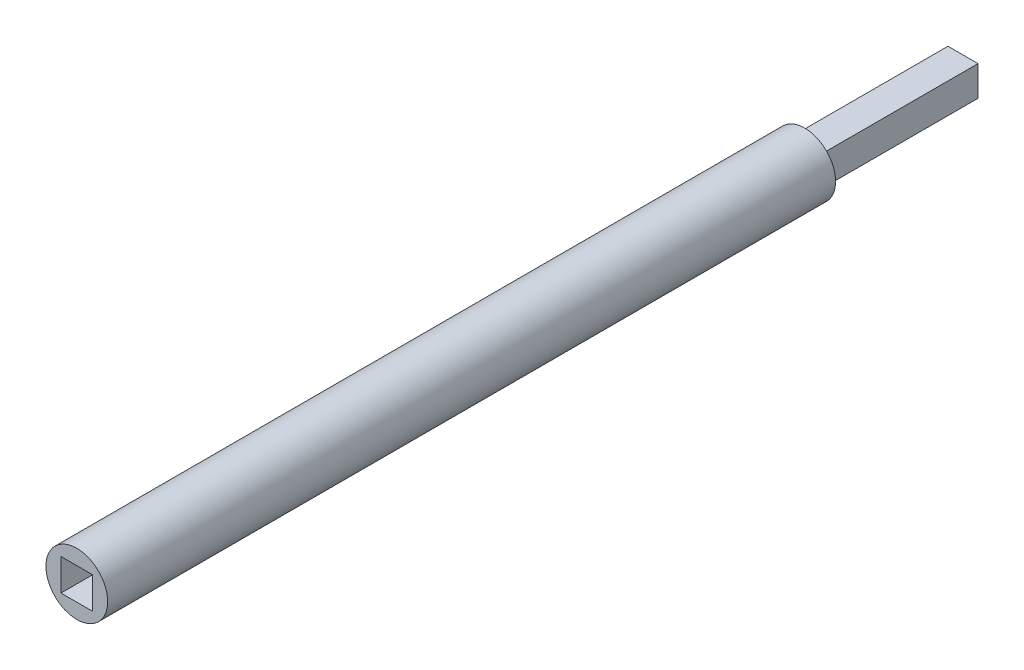
ISO-10303-21;
HEADER;
FILE_DESCRIPTION(('STEP AP214'),'2;1');
FILE_NAME('part.step','',(''),(''),'','','');
FILE_SCHEMA(('AUTOMOTIVE_DESIGN { 1 0 10303 214 1 1 1 1 }'));
ENDSEC;
DATA;
#1=APPLICATION_CONTEXT('core data for automotive mechanical design processes');
#2=APPLICATION_PROTOCOL_DEFINITION('international standard','automotive_design',2000,#1);
#3=PRODUCT_CONTEXT('',#1,'mechanical');
#4=PRODUCT('Part','Part','',(#3));
#5=PRODUCT_RELATED_PRODUCT_CATEGORY('part','',(#4));
#6=PRODUCT_DEFINITION_FORMATION('','',#4);
#7=PRODUCT_DEFINITION_CONTEXT('part definition',#1,'design');
#8=PRODUCT_DEFINITION('design','',#6,#7);
#9=PRODUCT_DEFINITION_SHAPE('','',#8);
#10=(LENGTH_UNIT() NAMED_UNIT(*) SI_UNIT(.MILLI.,.METRE.));
#11=(NAMED_UNIT(*) PLANE_ANGLE_UNIT() SI_UNIT($,.RADIAN.));
#12=(NAMED_UNIT(*) SI_UNIT($,.STERADIAN.) SOLID_ANGLE_UNIT());
#13=UNCERTAINTY_MEASURE_WITH_UNIT(LENGTH_MEASURE(1.E-05),#10,'distance_accuracy_value','');
#14=(GEOMETRIC_REPRESENTATION_CONTEXT(3) GLOBAL_UNCERTAINTY_ASSIGNED_CONTEXT((#13)) GLOBAL_UNIT_ASSIGNED_CONTEXT((#10,
#11,#12)) REPRESENTATION_CONTEXT('',''));
#15=CARTESIAN_POINT('',(0.,0.,0.));
#16=DIRECTION('',(0.,0.,1.));
#17=DIRECTION('',(1.,0.,0.));
#18=AXIS2_PLACEMENT_3D('',#15,#16,#17);
#19=CARTESIAN_POINT('',(0.,0.,0.));
#20=DIRECTION('',(0.,0.,1.));
#21=DIRECTION('',(1.,0.,0.));
#22=AXIS2_PLACEMENT_3D('',#19,#20,#21);
#23=PLANE('',#22);
#24=CARTESIAN_POINT('',(0.,0.,0.));
#25=DIRECTION('',(0.,0.,1.));
#26=DIRECTION('',(1.,0.,0.));
#27=AXIS2_PLACEMENT_3D('',#24,#25,#26);
#28=CIRCLE('',#27,0.975);
#29=CARTESIAN_POINT('',(0.975,0.,0.));
#30=VERTEX_POINT('',#29);
#31=EDGE_CURVE('E48',#30,#30,#28,.T.);
#32=ORIENTED_EDGE('',*,*,#31,.F.);
#33=EDGE_LOOP('',(#32));
#34=FACE_BOUND('',#33,.T.);
#35=DIRECTION('',(0.,1.,0.));
#36=VECTOR('',#35,1.);
#37=CARTESIAN_POINT('',(-0.475,0.475,0.));
#38=LINE('',#37,#36);
#39=CARTESIAN_POINT('',(-0.475,-0.475,0.));
#40=VERTEX_POINT('',#39);
#41=CARTESIAN_POINT('',(-0.475,0.475,0.));
#42=VERTEX_POINT('',#41);
#43=EDGE_CURVE('E68',#40,#42,#38,.T.);
#44=ORIENTED_EDGE('',*,*,#43,.F.);
#45=DIRECTION('',(-1.,0.,0.));
#46=VECTOR('',#45,1.);
#47=CARTESIAN_POINT('',(0.475,-0.475,0.));
#48=LINE('',#47,#46);
#49=CARTESIAN_POINT('',(0.475,-0.475,0.));
#50=VERTEX_POINT('',#49);
#51=EDGE_CURVE('E165',#50,#40,#48,.T.);
#52=ORIENTED_EDGE('',*,*,#51,.F.);
#53=DIRECTION('',(0.,-1.,0.));
#54=VECTOR('',#53,1.);
#55=CARTESIAN_POINT('',(0.475,0.475,0.));
#56=LINE('',#55,#54);
#57=CARTESIAN_POINT('',(0.475,0.475,0.));
#58=VERTEX_POINT('',#57);
#59=EDGE_CURVE('E181',#58,#50,#56,.T.);
#60=ORIENTED_EDGE('',*,*,#59,.F.);
#61=DIRECTION('',(1.,0.,0.));
#62=VECTOR('',#61,1.);
#63=CARTESIAN_POINT('',(0.475,0.475,0.));
#64=LINE('',#63,#62);
#65=EDGE_CURVE('E177',#42,#58,#64,.T.);
#66=ORIENTED_EDGE('',*,*,#65,.F.);
#67=EDGE_LOOP('',(#44,#52,#60,#66));
#68=FACE_BOUND('',#67,.T.);
#69=ADVANCED_FACE('F44',(#34,#68),#23,.F.);
#70=CARTESIAN_POINT('',(0.,0.,23.));
#71=DIRECTION('',(0.,0.,-1.));
#72=DIRECTION('',(-1.,0.,0.));
#73=AXIS2_PLACEMENT_3D('',#70,#71,#72);
#74=CYLINDRICAL_SURFACE('',#73,0.975);
#75=CARTESIAN_POINT('',(0.,0.,23.));
#76=DIRECTION('',(0.,0.,1.));
#77=DIRECTION('',(1.,0.,0.));
#78=AXIS2_PLACEMENT_3D('',#75,#76,#77);
#79=CIRCLE('',#78,0.975);
#80=CARTESIAN_POINT('',(0.975,0.,23.));
#81=VERTEX_POINT('',#80);
#82=EDGE_CURVE('E11',#81,#81,#79,.T.);
#83=ORIENTED_EDGE('',*,*,#82,.F.);
#84=EDGE_LOOP('',(#83));
#85=FACE_BOUND('',#84,.T.);
#86=ORIENTED_EDGE('',*,*,#31,.T.);
#87=EDGE_LOOP('',(#86));
#88=FACE_BOUND('',#87,.T.);
#89=ADVANCED_FACE('F46',(#85,#88),#74,.T.);
#90=CARTESIAN_POINT('',(0.,0.,23.));
#91=DIRECTION('',(0.,0.,1.));
#92=DIRECTION('',(1.,0.,0.));
#93=AXIS2_PLACEMENT_3D('',#90,#91,#92);
#94=PLANE('',#93);
#95=DIRECTION('',(0.,1.,0.));
#96=VECTOR('',#95,1.);
#97=CARTESIAN_POINT('',(0.5,0.5,23.));
#98=LINE('',#97,#96);
#99=CARTESIAN_POINT('',(0.5,-0.5,23.));
#100=VERTEX_POINT('',#99);
#101=CARTESIAN_POINT('',(0.5,0.5,23.));
#102=VERTEX_POINT('',#101);
#103=EDGE_CURVE('E60',#100,#102,#98,.T.);
#104=ORIENTED_EDGE('',*,*,#103,.F.);
#105=DIRECTION('',(1.,0.,0.));
#106=VECTOR('',#105,1.);
#107=CARTESIAN_POINT('',(-0.5,-0.5,23.));
#108=LINE('',#107,#106);
#109=CARTESIAN_POINT('',(-0.5,-0.5,23.));
#110=VERTEX_POINT('',#109);
#111=EDGE_CURVE('E133',#110,#100,#108,.T.);
#112=ORIENTED_EDGE('',*,*,#111,.F.);
#113=DIRECTION('',(0.,-1.,0.));
#114=VECTOR('',#113,1.);
#115=CARTESIAN_POINT('',(-0.5,0.5,23.));
#116=LINE('',#115,#114);
#117=CARTESIAN_POINT('',(-0.5,0.5,23.));
#118=VERTEX_POINT('',#117);
#119=EDGE_CURVE('E137',#118,#110,#116,.T.);
#120=ORIENTED_EDGE('',*,*,#119,.F.);
#121=DIRECTION('',(-1.,0.,0.));
#122=VECTOR('',#121,1.);
#123=CARTESIAN_POINT('',(-0.5,0.5,23.));
#124=LINE('',#123,#122);
#125=EDGE_CURVE('E146',#102,#118,#124,.T.);
#126=ORIENTED_EDGE('',*,*,#125,.F.);
#127=EDGE_LOOP('',(#104,#112,#120,#126));
#128=FACE_BOUND('',#127,.T.);
#129=ORIENTED_EDGE('',*,*,#82,.T.);
#130=EDGE_LOOP('',(#129));
#131=FACE_BOUND('',#130,.T.);
#132=ADVANCED_FACE('F212',(#128,#131),#94,.T.);
#133=CARTESIAN_POINT('',(-0.475,0.475,-5.));
#134=DIRECTION('',(1.,0.,0.));
#135=DIRECTION('',(0.,1.,0.));
#136=AXIS2_PLACEMENT_3D('',#133,#134,#135);
#137=PLANE('',#136);
#138=ORIENTED_EDGE('',*,*,#43,.T.);
#139=DIRECTION('',(0.,0.,1.));
#140=VECTOR('',#139,1.);
#141=CARTESIAN_POINT('',(-0.475,0.475,-5.));
#142=LINE('',#141,#140);
#143=CARTESIAN_POINT('',(-0.475,0.475,-5.));
#144=VERTEX_POINT('',#143);
#145=EDGE_CURVE('E198',#144,#42,#142,.T.);
#146=ORIENTED_EDGE('',*,*,#145,.F.);
#147=DIRECTION('',(0.,1.,0.));
#148=VECTOR('',#147,1.);
#149=CARTESIAN_POINT('',(-0.475,0.475,-5.));
#150=LINE('',#149,#148);
#151=CARTESIAN_POINT('',(-0.475,-0.475,-5.));
#152=VERTEX_POINT('',#151);
#153=EDGE_CURVE('E160',#152,#144,#150,.T.);
#154=ORIENTED_EDGE('',*,*,#153,.F.);
#155=DIRECTION('',(0.,0.,1.));
#156=VECTOR('',#155,1.);
#157=CARTESIAN_POINT('',(-0.475,-0.475,-5.));
#158=LINE('',#157,#156);
#159=EDGE_CURVE('E174',#152,#40,#158,.T.);
#160=ORIENTED_EDGE('',*,*,#159,.T.);
#161=EDGE_LOOP('',(#138,#146,#154,#160));
#162=FACE_BOUND('',#161,.T.);
#163=ADVANCED_FACE('F217',(#162),#137,.F.);
#164=CARTESIAN_POINT('',(0.475,0.475,-5.));
#165=DIRECTION('',(0.,-1.,0.));
#166=DIRECTION('',(0.,0.,-1.));
#167=AXIS2_PLACEMENT_3D('',#164,#165,#166);
#168=PLANE('',#167);
#169=ORIENTED_EDGE('',*,*,#65,.T.);
#170=DIRECTION('',(0.,0.,1.));
#171=VECTOR('',#170,1.);
#172=CARTESIAN_POINT('',(0.475,0.475,-5.));
#173=LINE('',#172,#171);
#174=CARTESIAN_POINT('',(0.475,0.475,-5.));
#175=VERTEX_POINT('',#174);
#176=EDGE_CURVE('E194',#175,#58,#173,.T.);
#177=ORIENTED_EDGE('',*,*,#176,.F.);
#178=DIRECTION('',(1.,0.,0.));
#179=VECTOR('',#178,1.);
#180=CARTESIAN_POINT('',(0.475,0.475,-5.));
#181=LINE('',#180,#179);
#182=EDGE_CURVE('E164',#144,#175,#181,.T.);
#183=ORIENTED_EDGE('',*,*,#182,.F.);
#184=ORIENTED_EDGE('',*,*,#145,.T.);
#185=EDGE_LOOP('',(#169,#177,#183,#184));
#186=FACE_BOUND('',#185,.T.);
#187=ADVANCED_FACE('F221',(#186),#168,.F.);
#188=CARTESIAN_POINT('',(0.475,0.475,-5.));
#189=DIRECTION('',(-1.,0.,0.));
#190=DIRECTION('',(0.,-1.,0.));
#191=AXIS2_PLACEMENT_3D('',#188,#189,#190);
#192=PLANE('',#191);
#193=ORIENTED_EDGE('',*,*,#59,.T.);
#194=DIRECTION('',(0.,0.,1.));
#195=VECTOR('',#194,1.);
#196=CARTESIAN_POINT('',(0.475,-0.475,-5.));
#197=LINE('',#196,#195);
#198=CARTESIAN_POINT('',(0.475,-0.475,-5.));
#199=VERTEX_POINT('',#198);
#200=EDGE_CURVE('E190',#199,#50,#197,.T.);
#201=ORIENTED_EDGE('',*,*,#200,.F.);
#202=DIRECTION('',(0.,-1.,0.));
#203=VECTOR('',#202,1.);
#204=CARTESIAN_POINT('',(0.475,0.475,-5.));
#205=LINE('',#204,#203);
#206=EDGE_CURVE('E168',#175,#199,#205,.T.);
#207=ORIENTED_EDGE('',*,*,#206,.F.);
#208=ORIENTED_EDGE('',*,*,#176,.T.);
#209=EDGE_LOOP('',(#193,#201,#207,#208));
#210=FACE_BOUND('',#209,.T.);
#211=ADVANCED_FACE('F225',(#210),#192,.F.);
#212=CARTESIAN_POINT('',(0.475,-0.475,-5.));
#213=DIRECTION('',(0.,1.,0.));
#214=DIRECTION('',(0.,0.,1.));
#215=AXIS2_PLACEMENT_3D('',#212,#213,#214);
#216=PLANE('',#215);
#217=ORIENTED_EDGE('',*,*,#51,.T.);
#218=ORIENTED_EDGE('',*,*,#159,.F.);
#219=DIRECTION('',(-1.,0.,0.));
#220=VECTOR('',#219,1.);
#221=CARTESIAN_POINT('',(0.475,-0.475,-5.));
#222=LINE('',#221,#220);
#223=EDGE_CURVE('E171',#199,#152,#222,.T.);
#224=ORIENTED_EDGE('',*,*,#223,.F.);
#225=ORIENTED_EDGE('',*,*,#200,.T.);
#226=EDGE_LOOP('',(#217,#218,#224,#225));
#227=FACE_BOUND('',#226,.T.);
#228=ADVANCED_FACE('F228',(#227),#216,.F.);
#229=CARTESIAN_POINT('',(0.,0.,-5.));
#230=DIRECTION('',(0.,0.,-1.));
#231=DIRECTION('',(-1.,0.,0.));
#232=AXIS2_PLACEMENT_3D('',#229,#230,#231);
#233=PLANE('',#232);
#234=ORIENTED_EDGE('',*,*,#153,.T.);
#235=ORIENTED_EDGE('',*,*,#182,.T.);
#236=ORIENTED_EDGE('',*,*,#206,.T.);
#237=ORIENTED_EDGE('',*,*,#223,.T.);
#238=EDGE_LOOP('',(#234,#235,#236,#237));
#239=FACE_BOUND('',#238,.T.);
#240=ADVANCED_FACE('F232',(#239),#233,.T.);
#241=CARTESIAN_POINT('',(0.5,0.5,18.));
#242=DIRECTION('',(1.,0.,0.));
#243=DIRECTION('',(0.,1.,0.));
#244=AXIS2_PLACEMENT_3D('',#241,#242,#243);
#245=PLANE('',#244);
#246=ORIENTED_EDGE('',*,*,#103,.T.);
#247=DIRECTION('',(0.,0.,1.));
#248=VECTOR('',#247,1.);
#249=CARTESIAN_POINT('',(0.5,0.5,18.));
#250=LINE('',#249,#248);
#251=CARTESIAN_POINT('',(0.5,0.5,18.));
#252=VERTEX_POINT('',#251);
#253=EDGE_CURVE('E108',#252,#102,#250,.T.);
#254=ORIENTED_EDGE('',*,*,#253,.F.);
#255=DIRECTION('',(0.,1.,0.));
#256=VECTOR('',#255,1.);
#257=CARTESIAN_POINT('',(0.5,0.5,18.));
#258=LINE('',#257,#256);
#259=CARTESIAN_POINT('',(0.5,-0.5,18.));
#260=VERTEX_POINT('',#259);
#261=EDGE_CURVE('E112',#260,#252,#258,.T.);
#262=ORIENTED_EDGE('',*,*,#261,.F.);
#263=DIRECTION('',(0.,0.,1.));
#264=VECTOR('',#263,1.);
#265=CARTESIAN_POINT('',(0.5,-0.5,18.));
#266=LINE('',#265,#264);
#267=EDGE_CURVE('E152',#260,#100,#266,.T.);
#268=ORIENTED_EDGE('',*,*,#267,.T.);
#269=EDGE_LOOP('',(#246,#254,#262,#268));
#270=FACE_BOUND('',#269,.T.);
#271=ADVANCED_FACE('F110',(#270),#245,.F.);
#272=CARTESIAN_POINT('',(-0.5,-0.5,18.));
#273=DIRECTION('',(0.,-1.,0.));
#274=DIRECTION('',(0.,0.,-1.));
#275=AXIS2_PLACEMENT_3D('',#272,#273,#274);
#276=PLANE('',#275);
#277=ORIENTED_EDGE('',*,*,#111,.T.);
#278=ORIENTED_EDGE('',*,*,#267,.F.);
#279=DIRECTION('',(1.,0.,0.));
#280=VECTOR('',#279,1.);
#281=CARTESIAN_POINT('',(-0.5,-0.5,18.));
#282=LINE('',#281,#280);
#283=CARTESIAN_POINT('',(-0.5,-0.5,18.));
#284=VERTEX_POINT('',#283);
#285=EDGE_CURVE('E119',#284,#260,#282,.T.);
#286=ORIENTED_EDGE('',*,*,#285,.F.);
#287=DIRECTION('',(0.,0.,1.));
#288=VECTOR('',#287,1.);
#289=CARTESIAN_POINT('',(-0.5,-0.5,18.));
#290=LINE('',#289,#288);
#291=EDGE_CURVE('E155',#284,#110,#290,.T.);
#292=ORIENTED_EDGE('',*,*,#291,.T.);
#293=EDGE_LOOP('',(#277,#278,#286,#292));
#294=FACE_BOUND('',#293,.T.);
#295=ADVANCED_FACE('F239',(#294),#276,.F.);
#296=CARTESIAN_POINT('',(-0.5,0.5,18.));
#297=DIRECTION('',(-1.,0.,0.));
#298=DIRECTION('',(0.,-1.,0.));
#299=AXIS2_PLACEMENT_3D('',#296,#297,#298);
#300=PLANE('',#299);
#301=ORIENTED_EDGE('',*,*,#119,.T.);
#302=ORIENTED_EDGE('',*,*,#291,.F.);
#303=DIRECTION('',(0.,-1.,0.));
#304=VECTOR('',#303,1.);
#305=CARTESIAN_POINT('',(-0.5,0.5,18.));
#306=LINE('',#305,#304);
#307=CARTESIAN_POINT('',(-0.5,0.5,18.));
#308=VERTEX_POINT('',#307);
#309=EDGE_CURVE('E128',#308,#284,#306,.T.);
#310=ORIENTED_EDGE('',*,*,#309,.F.);
#311=DIRECTION('',(0.,0.,1.));
#312=VECTOR('',#311,1.);
#313=CARTESIAN_POINT('',(-0.5,0.5,18.));
#314=LINE('',#313,#312);
#315=EDGE_CURVE('E118',#308,#118,#314,.T.);
#316=ORIENTED_EDGE('',*,*,#315,.T.);
#317=EDGE_LOOP('',(#301,#302,#310,#316));
#318=FACE_BOUND('',#317,.T.);
#319=ADVANCED_FACE('F242',(#318),#300,.F.);
#320=CARTESIAN_POINT('',(-0.5,0.5,18.));
#321=DIRECTION('',(0.,1.,0.));
#322=DIRECTION('',(0.,0.,1.));
#323=AXIS2_PLACEMENT_3D('',#320,#321,#322);
#324=PLANE('',#323);
#325=ORIENTED_EDGE('',*,*,#125,.T.);
#326=ORIENTED_EDGE('',*,*,#315,.F.);
#327=DIRECTION('',(-1.,0.,0.));
#328=VECTOR('',#327,1.);
#329=CARTESIAN_POINT('',(-0.5,0.5,18.));
#330=LINE('',#329,#328);
#331=EDGE_CURVE('E122',#252,#308,#330,.T.);
#332=ORIENTED_EDGE('',*,*,#331,.F.);
#333=ORIENTED_EDGE('',*,*,#253,.T.);
#334=EDGE_LOOP('',(#325,#326,#332,#333));
#335=FACE_BOUND('',#334,.T.);
#336=ADVANCED_FACE('F123',(#335),#324,.F.);
#337=CARTESIAN_POINT('',(0.,0.,18.));
#338=DIRECTION('',(0.,0.,1.));
#339=DIRECTION('',(1.,0.,0.));
#340=AXIS2_PLACEMENT_3D('',#337,#338,#339);
#341=PLANE('',#340);
#342=ORIENTED_EDGE('',*,*,#261,.T.);
#343=ORIENTED_EDGE('',*,*,#331,.T.);
#344=ORIENTED_EDGE('',*,*,#309,.T.);
#345=ORIENTED_EDGE('',*,*,#285,.T.);
#346=EDGE_LOOP('',(#342,#343,#344,#345));
#347=FACE_BOUND('',#346,.T.);
#348=ADVANCED_FACE('F130',(#347),#341,.T.);
#349=CLOSED_SHELL('',(#69,#89,#132,#163,#187,#211,#228,#240,#271,#295,#319,#336,#348));
#350=MANIFOLD_SOLID_BREP('B2',#349);
#351=ADVANCED_BREP_SHAPE_REPRESENTATION('',(#18,#350),#14);
#352=SHAPE_DEFINITION_REPRESENTATION(#9,#351);
ENDSEC;
END-ISO-10303-21;
